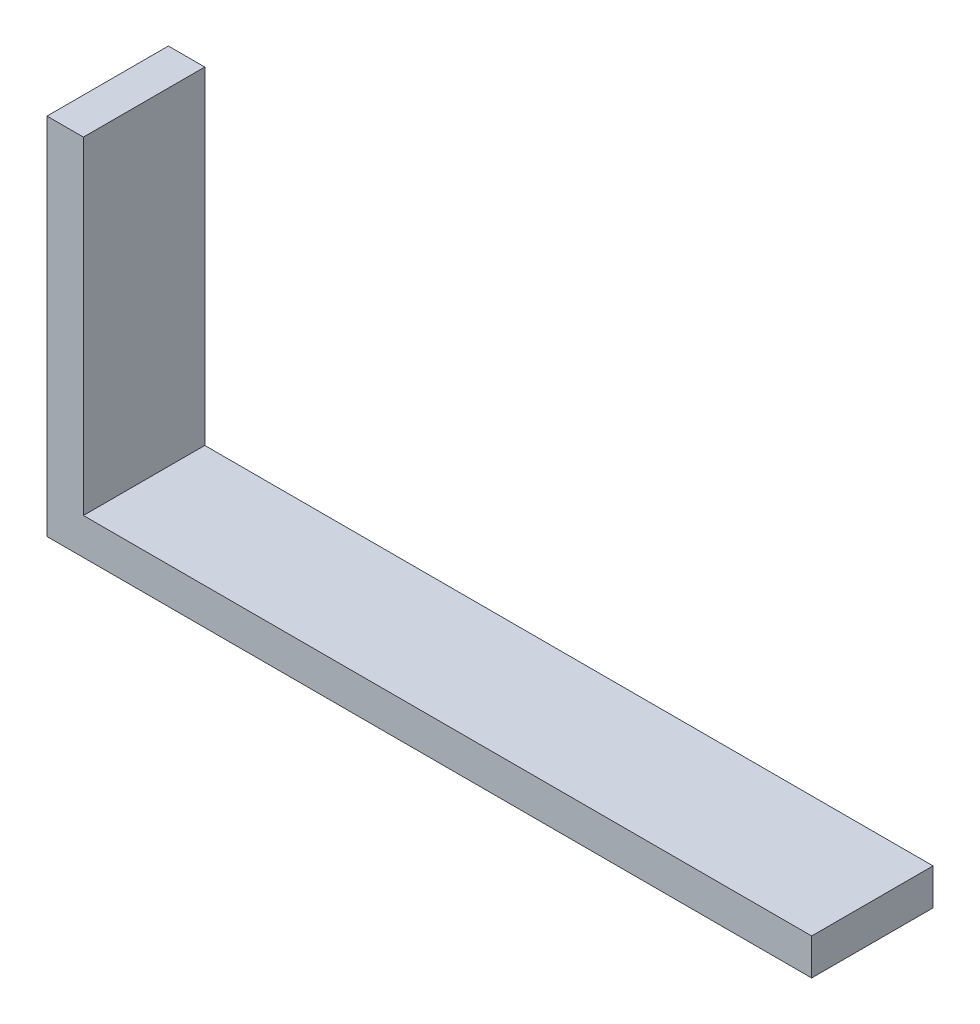
ISO-10303-21;
HEADER;
FILE_DESCRIPTION(('STEP AP214'),'2;1');
FILE_NAME('part.step','',(''),(''),'','','');
FILE_SCHEMA(('AUTOMOTIVE_DESIGN { 1 0 10303 214 1 1 1 1 }'));
ENDSEC;
DATA;
#1=APPLICATION_CONTEXT('core data for automotive mechanical design processes');
#2=APPLICATION_PROTOCOL_DEFINITION('international standard','automotive_design',2000,#1);
#3=PRODUCT_CONTEXT('',#1,'mechanical');
#4=PRODUCT('Part','Part','',(#3));
#5=PRODUCT_RELATED_PRODUCT_CATEGORY('part','',(#4));
#6=PRODUCT_DEFINITION_FORMATION('','',#4);
#7=PRODUCT_DEFINITION_CONTEXT('part definition',#1,'design');
#8=PRODUCT_DEFINITION('design','',#6,#7);
#9=PRODUCT_DEFINITION_SHAPE('','',#8);
#10=(LENGTH_UNIT() NAMED_UNIT(*) SI_UNIT(.MILLI.,.METRE.));
#11=(NAMED_UNIT(*) PLANE_ANGLE_UNIT() SI_UNIT($,.RADIAN.));
#12=(NAMED_UNIT(*) SI_UNIT($,.STERADIAN.) SOLID_ANGLE_UNIT());
#13=UNCERTAINTY_MEASURE_WITH_UNIT(LENGTH_MEASURE(1.E-05),#10,'distance_accuracy_value','');
#14=(GEOMETRIC_REPRESENTATION_CONTEXT(3) GLOBAL_UNCERTAINTY_ASSIGNED_CONTEXT((#13)) GLOBAL_UNIT_ASSIGNED_CONTEXT((#10,
#11,#12)) REPRESENTATION_CONTEXT('',''));
#15=CARTESIAN_POINT('',(0.,0.,0.));
#16=DIRECTION('',(0.,0.,1.));
#17=DIRECTION('',(1.,0.,0.));
#18=AXIS2_PLACEMENT_3D('',#15,#16,#17);
#19=CARTESIAN_POINT('',(63.,0.,10.));
#20=DIRECTION('',(0.,1.,0.));
#21=DIRECTION('',(-1.,0.,0.));
#22=AXIS2_PLACEMENT_3D('',#19,#20,#21);
#23=PLANE('',#22);
#24=DIRECTION('',(1.,0.,0.));
#25=VECTOR('',#24,1.);
#26=CARTESIAN_POINT('',(63.,0.,0.));
#27=LINE('',#26,#25);
#28=CARTESIAN_POINT('',(0.,0.,0.));
#29=VERTEX_POINT('',#28);
#30=CARTESIAN_POINT('',(63.,0.,0.));
#31=VERTEX_POINT('',#30);
#32=EDGE_CURVE('E119',#29,#31,#27,.T.);
#33=ORIENTED_EDGE('',*,*,#32,.T.);
#34=DIRECTION('',(0.,0.,-1.));
#35=VECTOR('',#34,1.);
#36=CARTESIAN_POINT('',(63.,0.,10.));
#37=LINE('',#36,#35);
#38=CARTESIAN_POINT('',(63.,0.,10.));
#39=VERTEX_POINT('',#38);
#40=EDGE_CURVE('E11',#39,#31,#37,.T.);
#41=ORIENTED_EDGE('',*,*,#40,.F.);
#42=DIRECTION('',(1.,0.,0.));
#43=VECTOR('',#42,1.);
#44=CARTESIAN_POINT('',(63.,0.,10.));
#45=LINE('',#44,#43);
#46=CARTESIAN_POINT('',(0.,0.,10.));
#47=VERTEX_POINT('',#46);
#48=EDGE_CURVE('E129',#47,#39,#45,.T.);
#49=ORIENTED_EDGE('',*,*,#48,.F.);
#50=DIRECTION('',(0.,0.,-1.));
#51=VECTOR('',#50,1.);
#52=CARTESIAN_POINT('',(0.,0.,10.));
#53=LINE('',#52,#51);
#54=EDGE_CURVE('E115',#47,#29,#53,.T.);
#55=ORIENTED_EDGE('',*,*,#54,.T.);
#56=EDGE_LOOP('',(#33,#41,#49,#55));
#57=FACE_BOUND('',#56,.T.);
#58=ADVANCED_FACE('F35',(#57),#23,.F.);
#59=CARTESIAN_POINT('',(63.,3.,10.));
#60=DIRECTION('',(-1.,0.,0.));
#61=DIRECTION('',(0.,-1.,0.));
#62=AXIS2_PLACEMENT_3D('',#59,#60,#61);
#63=PLANE('',#62);
#64=DIRECTION('',(0.,1.,0.));
#65=VECTOR('',#64,1.);
#66=CARTESIAN_POINT('',(63.,3.,0.));
#67=LINE('',#66,#65);
#68=CARTESIAN_POINT('',(63.,3.,0.));
#69=VERTEX_POINT('',#68);
#70=EDGE_CURVE('E122',#31,#69,#67,.T.);
#71=ORIENTED_EDGE('',*,*,#70,.T.);
#72=DIRECTION('',(0.,0.,-1.));
#73=VECTOR('',#72,1.);
#74=CARTESIAN_POINT('',(63.,3.,10.));
#75=LINE('',#74,#73);
#76=CARTESIAN_POINT('',(63.,3.,10.));
#77=VERTEX_POINT('',#76);
#78=EDGE_CURVE('E43',#77,#69,#75,.T.);
#79=ORIENTED_EDGE('',*,*,#78,.F.);
#80=DIRECTION('',(0.,1.,0.));
#81=VECTOR('',#80,1.);
#82=CARTESIAN_POINT('',(63.,3.,10.));
#83=LINE('',#82,#81);
#84=EDGE_CURVE('E88',#39,#77,#83,.T.);
#85=ORIENTED_EDGE('',*,*,#84,.F.);
#86=ORIENTED_EDGE('',*,*,#40,.T.);
#87=EDGE_LOOP('',(#71,#79,#85,#86));
#88=FACE_BOUND('',#87,.T.);
#89=ADVANCED_FACE('F153',(#88),#63,.F.);
#90=CARTESIAN_POINT('',(3.00000000000001,3.,10.));
#91=DIRECTION('',(0.,-1.,0.));
#92=DIRECTION('',(0.,0.,-1.));
#93=AXIS2_PLACEMENT_3D('',#90,#91,#92);
#94=PLANE('',#93);
#95=DIRECTION('',(-1.,0.,0.));
#96=VECTOR('',#95,1.);
#97=CARTESIAN_POINT('',(3.00000000000001,3.,0.));
#98=LINE('',#97,#96);
#99=CARTESIAN_POINT('',(3.00000000000001,3.,0.));
#100=VERTEX_POINT('',#99);
#101=EDGE_CURVE('E124',#69,#100,#98,.T.);
#102=ORIENTED_EDGE('',*,*,#101,.T.);
#103=DIRECTION('',(0.,0.,-1.));
#104=VECTOR('',#103,1.);
#105=CARTESIAN_POINT('',(3.00000000000001,3.,10.));
#106=LINE('',#105,#104);
#107=CARTESIAN_POINT('',(3.00000000000001,3.,10.));
#108=VERTEX_POINT('',#107);
#109=EDGE_CURVE('E110',#108,#100,#106,.T.);
#110=ORIENTED_EDGE('',*,*,#109,.F.);
#111=DIRECTION('',(-1.,0.,0.));
#112=VECTOR('',#111,1.);
#113=CARTESIAN_POINT('',(3.00000000000001,3.,10.));
#114=LINE('',#113,#112);
#115=EDGE_CURVE('E101',#77,#108,#114,.T.);
#116=ORIENTED_EDGE('',*,*,#115,.F.);
#117=ORIENTED_EDGE('',*,*,#78,.T.);
#118=EDGE_LOOP('',(#102,#110,#116,#117));
#119=FACE_BOUND('',#118,.T.);
#120=ADVANCED_FACE('F135',(#119),#94,.F.);
#121=CARTESIAN_POINT('',(3.,30.,10.));
#122=DIRECTION('',(-1.,0.,0.));
#123=DIRECTION('',(0.,-1.,0.));
#124=AXIS2_PLACEMENT_3D('',#121,#122,#123);
#125=PLANE('',#124);
#126=DIRECTION('',(0.,1.,0.));
#127=VECTOR('',#126,1.);
#128=CARTESIAN_POINT('',(3.,30.,0.));
#129=LINE('',#128,#127);
#130=CARTESIAN_POINT('',(3.,30.,0.));
#131=VERTEX_POINT('',#130);
#132=EDGE_CURVE('E109',#100,#131,#129,.T.);
#133=ORIENTED_EDGE('',*,*,#132,.T.);
#134=DIRECTION('',(0.,0.,-1.));
#135=VECTOR('',#134,1.);
#136=CARTESIAN_POINT('',(3.,30.,10.));
#137=LINE('',#136,#135);
#138=CARTESIAN_POINT('',(3.,30.,10.));
#139=VERTEX_POINT('',#138);
#140=EDGE_CURVE('E106',#139,#131,#137,.T.);
#141=ORIENTED_EDGE('',*,*,#140,.F.);
#142=DIRECTION('',(0.,1.,0.));
#143=VECTOR('',#142,1.);
#144=CARTESIAN_POINT('',(3.,30.,10.));
#145=LINE('',#144,#143);
#146=EDGE_CURVE('E95',#108,#139,#145,.T.);
#147=ORIENTED_EDGE('',*,*,#146,.F.);
#148=ORIENTED_EDGE('',*,*,#109,.T.);
#149=EDGE_LOOP('',(#133,#141,#147,#148));
#150=FACE_BOUND('',#149,.T.);
#151=ADVANCED_FACE('F107',(#150),#125,.F.);
#152=CARTESIAN_POINT('',(0.,30.,10.));
#153=DIRECTION('',(0.,-1.,0.));
#154=DIRECTION('',(0.,0.,-1.));
#155=AXIS2_PLACEMENT_3D('',#152,#153,#154);
#156=PLANE('',#155);
#157=DIRECTION('',(-1.,0.,0.));
#158=VECTOR('',#157,1.);
#159=CARTESIAN_POINT('',(0.,30.,0.));
#160=LINE('',#159,#158);
#161=CARTESIAN_POINT('',(0.,30.,0.));
#162=VERTEX_POINT('',#161);
#163=EDGE_CURVE('E74',#131,#162,#160,.T.);
#164=ORIENTED_EDGE('',*,*,#163,.T.);
#165=DIRECTION('',(0.,0.,-1.));
#166=VECTOR('',#165,1.);
#167=CARTESIAN_POINT('',(0.,30.,10.));
#168=LINE('',#167,#166);
#169=CARTESIAN_POINT('',(0.,30.,10.));
#170=VERTEX_POINT('',#169);
#171=EDGE_CURVE('E111',#170,#162,#168,.T.);
#172=ORIENTED_EDGE('',*,*,#171,.F.);
#173=DIRECTION('',(-1.,0.,0.));
#174=VECTOR('',#173,1.);
#175=CARTESIAN_POINT('',(0.,30.,10.));
#176=LINE('',#175,#174);
#177=EDGE_CURVE('E99',#139,#170,#176,.T.);
#178=ORIENTED_EDGE('',*,*,#177,.F.);
#179=ORIENTED_EDGE('',*,*,#140,.T.);
#180=EDGE_LOOP('',(#164,#172,#178,#179));
#181=FACE_BOUND('',#180,.T.);
#182=ADVANCED_FACE('F113',(#181),#156,.F.);
#183=CARTESIAN_POINT('',(0.,0.,10.));
#184=DIRECTION('',(1.,0.,0.));
#185=DIRECTION('',(0.,0.,-1.));
#186=AXIS2_PLACEMENT_3D('',#183,#184,#185);
#187=PLANE('',#186);
#188=DIRECTION('',(0.,-1.,0.));
#189=VECTOR('',#188,1.);
#190=CARTESIAN_POINT('',(0.,0.,0.));
#191=LINE('',#190,#189);
#192=EDGE_CURVE('E80',#162,#29,#191,.T.);
#193=ORIENTED_EDGE('',*,*,#192,.T.);
#194=ORIENTED_EDGE('',*,*,#54,.F.);
#195=DIRECTION('',(0.,-1.,0.));
#196=VECTOR('',#195,1.);
#197=CARTESIAN_POINT('',(0.,0.,10.));
#198=LINE('',#197,#196);
#199=EDGE_CURVE('E51',#170,#47,#198,.T.);
#200=ORIENTED_EDGE('',*,*,#199,.F.);
#201=ORIENTED_EDGE('',*,*,#171,.T.);
#202=EDGE_LOOP('',(#193,#194,#200,#201));
#203=FACE_BOUND('',#202,.T.);
#204=ADVANCED_FACE('F142',(#203),#187,.F.);
#205=CARTESIAN_POINT('',(0.,0.,10.));
#206=DIRECTION('',(0.,0.,-1.));
#207=DIRECTION('',(-1.,0.,0.));
#208=AXIS2_PLACEMENT_3D('',#205,#206,#207);
#209=PLANE('',#208);
#210=ORIENTED_EDGE('',*,*,#48,.T.);
#211=ORIENTED_EDGE('',*,*,#84,.T.);
#212=ORIENTED_EDGE('',*,*,#115,.T.);
#213=ORIENTED_EDGE('',*,*,#146,.T.);
#214=ORIENTED_EDGE('',*,*,#177,.T.);
#215=ORIENTED_EDGE('',*,*,#199,.T.);
#216=EDGE_LOOP('',(#210,#211,#212,#213,#214,#215));
#217=FACE_BOUND('',#216,.T.);
#218=ADVANCED_FACE('F97',(#217),#209,.F.);
#219=CARTESIAN_POINT('',(0.,0.,0.));
#220=DIRECTION('',(0.,0.,-1.));
#221=DIRECTION('',(-1.,0.,0.));
#222=AXIS2_PLACEMENT_3D('',#219,#220,#221);
#223=PLANE('',#222);
#224=ORIENTED_EDGE('',*,*,#32,.F.);
#225=ORIENTED_EDGE('',*,*,#192,.F.);
#226=ORIENTED_EDGE('',*,*,#163,.F.);
#227=ORIENTED_EDGE('',*,*,#132,.F.);
#228=ORIENTED_EDGE('',*,*,#101,.F.);
#229=ORIENTED_EDGE('',*,*,#70,.F.);
#230=EDGE_LOOP('',(#224,#225,#226,#227,#228,#229));
#231=FACE_BOUND('',#230,.T.);
#232=ADVANCED_FACE('F138',(#231),#223,.T.);
#233=CLOSED_SHELL('',(#58,#89,#120,#151,#182,#204,#218,#232));
#234=MANIFOLD_SOLID_BREP('B2',#233);
#235=ADVANCED_BREP_SHAPE_REPRESENTATION('',(#18,#234),#14);
#236=SHAPE_DEFINITION_REPRESENTATION(#9,#235);
ENDSEC;
END-ISO-10303-21;
